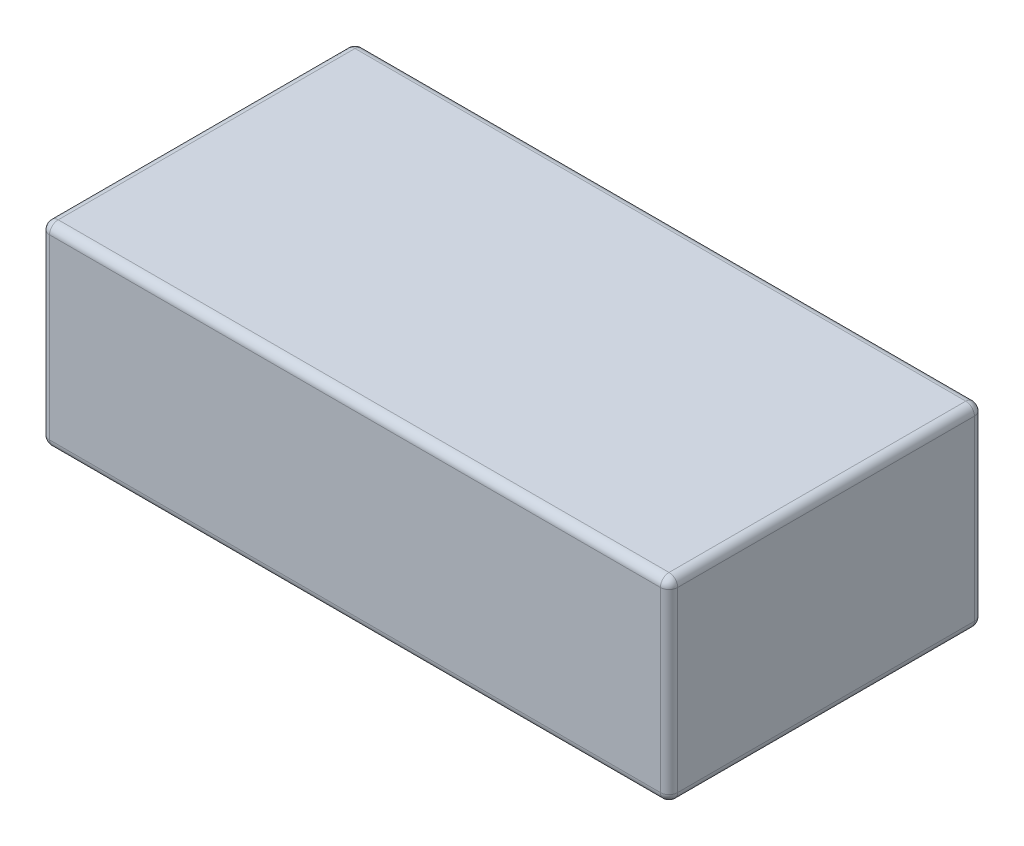
ISO-10303-21;
HEADER;
FILE_DESCRIPTION(('STEP AP214'),'2;1');
FILE_NAME('part.step','',(''),(''),'','','');
FILE_SCHEMA(('AUTOMOTIVE_DESIGN { 1 0 10303 214 1 1 1 1 }'));
ENDSEC;
DATA;
#1=APPLICATION_CONTEXT('core data for automotive mechanical design processes');
#2=APPLICATION_PROTOCOL_DEFINITION('international standard','automotive_design',2000,#1);
#3=PRODUCT_CONTEXT('',#1,'mechanical');
#4=PRODUCT('Part','Part','',(#3));
#5=PRODUCT_RELATED_PRODUCT_CATEGORY('part','',(#4));
#6=PRODUCT_DEFINITION_FORMATION('','',#4);
#7=PRODUCT_DEFINITION_CONTEXT('part definition',#1,'design');
#8=PRODUCT_DEFINITION('design','',#6,#7);
#9=PRODUCT_DEFINITION_SHAPE('','',#8);
#10=(LENGTH_UNIT() NAMED_UNIT(*) SI_UNIT(.MILLI.,.METRE.));
#11=(NAMED_UNIT(*) PLANE_ANGLE_UNIT() SI_UNIT($,.RADIAN.));
#12=(NAMED_UNIT(*) SI_UNIT($,.STERADIAN.) SOLID_ANGLE_UNIT());
#13=UNCERTAINTY_MEASURE_WITH_UNIT(LENGTH_MEASURE(1.E-05),#10,'distance_accuracy_value','');
#14=(GEOMETRIC_REPRESENTATION_CONTEXT(3) GLOBAL_UNCERTAINTY_ASSIGNED_CONTEXT((#13)) GLOBAL_UNIT_ASSIGNED_CONTEXT((#10,
#11,#12)) REPRESENTATION_CONTEXT('',''));
#15=CARTESIAN_POINT('',(0.,0.,0.));
#16=DIRECTION('',(0.,0.,1.));
#17=DIRECTION('',(1.,0.,0.));
#18=AXIS2_PLACEMENT_3D('',#15,#16,#17);
#19=CARTESIAN_POINT('',(92.075,57.15,-46.0375));
#20=DIRECTION('',(-1.,0.,0.));
#21=DIRECTION('',(0.,0.,1.));
#22=AXIS2_PLACEMENT_3D('',#19,#20,#21);
#23=PLANE('',#22);
#24=DIRECTION('',(0.,-1.,0.));
#25=VECTOR('',#24,1.);
#26=CARTESIAN_POINT('',(92.075,57.15,43.4975));
#27=LINE('',#26,#25);
#28=CARTESIAN_POINT('',(92.075,54.61,43.4975));
#29=VERTEX_POINT('',#28);
#30=CARTESIAN_POINT('',(92.075,2.54,43.4975));
#31=VERTEX_POINT('',#30);
#32=EDGE_CURVE('E168',#29,#31,#27,.T.);
#33=ORIENTED_EDGE('',*,*,#32,.T.);
#34=DIRECTION('',(0.,0.,-1.));
#35=VECTOR('',#34,1.);
#36=CARTESIAN_POINT('',(92.075,2.54,-46.0375));
#37=LINE('',#36,#35);
#38=CARTESIAN_POINT('',(92.075,2.54,-43.4975));
#39=VERTEX_POINT('',#38);
#40=EDGE_CURVE('E173',#31,#39,#37,.T.);
#41=ORIENTED_EDGE('',*,*,#40,.T.);
#42=DIRECTION('',(0.,-1.,0.));
#43=VECTOR('',#42,1.);
#44=CARTESIAN_POINT('',(92.075,57.15,-43.4975));
#45=LINE('',#44,#43);
#46=CARTESIAN_POINT('',(92.075,54.61,-43.4975));
#47=VERTEX_POINT('',#46);
#48=EDGE_CURVE('E170',#39,#47,#45,.F.);
#49=ORIENTED_EDGE('',*,*,#48,.T.);
#50=DIRECTION('',(0.,0.,-1.));
#51=VECTOR('',#50,1.);
#52=CARTESIAN_POINT('',(92.075,54.61,46.0375));
#53=LINE('',#52,#51);
#54=EDGE_CURVE('E166',#47,#29,#53,.F.);
#55=ORIENTED_EDGE('',*,*,#54,.T.);
#56=EDGE_LOOP('',(#33,#41,#49,#55));
#57=FACE_BOUND('',#56,.T.);
#58=ADVANCED_FACE('F35',(#57),#23,.F.);
#59=CARTESIAN_POINT('',(-92.075,57.15,-46.0375));
#60=DIRECTION('',(0.,0.,1.));
#61=DIRECTION('',(1.,0.,0.));
#62=AXIS2_PLACEMENT_3D('',#59,#60,#61);
#63=PLANE('',#62);
#64=DIRECTION('',(0.,-1.,0.));
#65=VECTOR('',#64,1.);
#66=CARTESIAN_POINT('',(89.535,57.15,-46.0375));
#67=LINE('',#66,#65);
#68=CARTESIAN_POINT('',(89.535,54.61,-46.0375));
#69=VERTEX_POINT('',#68);
#70=CARTESIAN_POINT('',(89.535,2.54,-46.0375));
#71=VERTEX_POINT('',#70);
#72=EDGE_CURVE('E134',#69,#71,#67,.T.);
#73=ORIENTED_EDGE('',*,*,#72,.T.);
#74=DIRECTION('',(-1.,0.,0.));
#75=VECTOR('',#74,1.);
#76=CARTESIAN_POINT('',(-92.075,2.54,-46.0375));
#77=LINE('',#76,#75);
#78=CARTESIAN_POINT('',(-89.535,2.54,-46.0375));
#79=VERTEX_POINT('',#78);
#80=EDGE_CURVE('E130',#71,#79,#77,.T.);
#81=ORIENTED_EDGE('',*,*,#80,.T.);
#82=DIRECTION('',(0.,-1.,0.));
#83=VECTOR('',#82,1.);
#84=CARTESIAN_POINT('',(-89.535,57.15,-46.0375));
#85=LINE('',#84,#83);
#86=CARTESIAN_POINT('',(-89.535,54.61,-46.0375));
#87=VERTEX_POINT('',#86);
#88=EDGE_CURVE('E122',#79,#87,#85,.F.);
#89=ORIENTED_EDGE('',*,*,#88,.T.);
#90=DIRECTION('',(-1.,0.,0.));
#91=VECTOR('',#90,1.);
#92=CARTESIAN_POINT('',(92.075,54.61,-46.0375));
#93=LINE('',#92,#91);
#94=EDGE_CURVE('E127',#87,#69,#93,.F.);
#95=ORIENTED_EDGE('',*,*,#94,.T.);
#96=EDGE_LOOP('',(#73,#81,#89,#95));
#97=FACE_BOUND('',#96,.T.);
#98=ADVANCED_FACE('F125',(#97),#63,.F.);
#99=CARTESIAN_POINT('',(-92.075,57.15,-46.0375));
#100=DIRECTION('',(1.,0.,0.));
#101=DIRECTION('',(0.,0.,-1.));
#102=AXIS2_PLACEMENT_3D('',#99,#100,#101);
#103=PLANE('',#102);
#104=DIRECTION('',(0.,-1.,0.));
#105=VECTOR('',#104,1.);
#106=CARTESIAN_POINT('',(-92.075,57.15,-43.4975));
#107=LINE('',#106,#105);
#108=CARTESIAN_POINT('',(-92.075,54.61,-43.4975));
#109=VERTEX_POINT('',#108);
#110=CARTESIAN_POINT('',(-92.075,2.54,-43.4975));
#111=VERTEX_POINT('',#110);
#112=EDGE_CURVE('E142',#109,#111,#107,.T.);
#113=ORIENTED_EDGE('',*,*,#112,.T.);
#114=DIRECTION('',(0.,0.,1.));
#115=VECTOR('',#114,1.);
#116=CARTESIAN_POINT('',(-92.075,2.54,-46.0375));
#117=LINE('',#116,#115);
#118=CARTESIAN_POINT('',(-92.075,2.54,43.4975));
#119=VERTEX_POINT('',#118);
#120=EDGE_CURVE('E180',#111,#119,#117,.T.);
#121=ORIENTED_EDGE('',*,*,#120,.T.);
#122=DIRECTION('',(0.,-1.,0.));
#123=VECTOR('',#122,1.);
#124=CARTESIAN_POINT('',(-92.075,57.15,43.4975));
#125=LINE('',#124,#123);
#126=CARTESIAN_POINT('',(-92.075,54.61,43.4975));
#127=VERTEX_POINT('',#126);
#128=EDGE_CURVE('E177',#119,#127,#125,.F.);
#129=ORIENTED_EDGE('',*,*,#128,.T.);
#130=DIRECTION('',(0.,0.,1.));
#131=VECTOR('',#130,1.);
#132=CARTESIAN_POINT('',(-92.075,54.61,-46.0375));
#133=LINE('',#132,#131);
#134=EDGE_CURVE('E175',#127,#109,#133,.F.);
#135=ORIENTED_EDGE('',*,*,#134,.T.);
#136=EDGE_LOOP('',(#113,#121,#129,#135));
#137=FACE_BOUND('',#136,.T.);
#138=ADVANCED_FACE('F326',(#137),#103,.F.);
#139=CARTESIAN_POINT('',(-92.075,57.15,46.0375));
#140=DIRECTION('',(0.,0.,-1.));
#141=DIRECTION('',(-1.,0.,0.));
#142=AXIS2_PLACEMENT_3D('',#139,#140,#141);
#143=PLANE('',#142);
#144=DIRECTION('',(0.,-1.,0.));
#145=VECTOR('',#144,1.);
#146=CARTESIAN_POINT('',(-89.535,57.15,46.0375));
#147=LINE('',#146,#145);
#148=CARTESIAN_POINT('',(-89.535,54.61,46.0375));
#149=VERTEX_POINT('',#148);
#150=CARTESIAN_POINT('',(-89.535,2.54,46.0375));
#151=VERTEX_POINT('',#150);
#152=EDGE_CURVE('E186',#149,#151,#147,.T.);
#153=ORIENTED_EDGE('',*,*,#152,.T.);
#154=DIRECTION('',(1.,0.,0.));
#155=VECTOR('',#154,1.);
#156=CARTESIAN_POINT('',(-92.075,2.54,46.0375));
#157=LINE('',#156,#155);
#158=CARTESIAN_POINT('',(89.535,2.54,46.0375));
#159=VERTEX_POINT('',#158);
#160=EDGE_CURVE('E189',#151,#159,#157,.T.);
#161=ORIENTED_EDGE('',*,*,#160,.T.);
#162=DIRECTION('',(0.,-1.,0.));
#163=VECTOR('',#162,1.);
#164=CARTESIAN_POINT('',(89.535,57.15,46.0375));
#165=LINE('',#164,#163);
#166=CARTESIAN_POINT('',(89.535,54.61,46.0375));
#167=VERTEX_POINT('',#166);
#168=EDGE_CURVE('E184',#159,#167,#165,.F.);
#169=ORIENTED_EDGE('',*,*,#168,.T.);
#170=DIRECTION('',(1.,0.,0.));
#171=VECTOR('',#170,1.);
#172=CARTESIAN_POINT('',(-92.075,54.61,46.0375));
#173=LINE('',#172,#171);
#174=EDGE_CURVE('E182',#167,#149,#173,.F.);
#175=ORIENTED_EDGE('',*,*,#174,.T.);
#176=EDGE_LOOP('',(#153,#161,#169,#175));
#177=FACE_BOUND('',#176,.T.);
#178=ADVANCED_FACE('F275',(#177),#143,.F.);
#179=CARTESIAN_POINT('',(0.,57.15,0.));
#180=DIRECTION('',(0.,1.,0.));
#181=DIRECTION('',(0.,0.,1.));
#182=AXIS2_PLACEMENT_3D('',#179,#180,#181);
#183=PLANE('',#182);
#184=DIRECTION('',(0.,0.,1.));
#185=VECTOR('',#184,1.);
#186=CARTESIAN_POINT('',(-89.535,57.15,46.0375));
#187=LINE('',#186,#185);
#188=CARTESIAN_POINT('',(-89.535,57.15,-43.4975));
#189=VERTEX_POINT('',#188);
#190=CARTESIAN_POINT('',(-89.535,57.15,43.4975));
#191=VERTEX_POINT('',#190);
#192=EDGE_CURVE('E44',#189,#191,#187,.T.);
#193=ORIENTED_EDGE('',*,*,#192,.T.);
#194=DIRECTION('',(1.,0.,0.));
#195=VECTOR('',#194,1.);
#196=CARTESIAN_POINT('',(92.075,57.15,43.4975));
#197=LINE('',#196,#195);
#198=CARTESIAN_POINT('',(89.535,57.15,43.4975));
#199=VERTEX_POINT('',#198);
#200=EDGE_CURVE('E11',#191,#199,#197,.T.);
#201=ORIENTED_EDGE('',*,*,#200,.T.);
#202=DIRECTION('',(0.,0.,-1.));
#203=VECTOR('',#202,1.);
#204=CARTESIAN_POINT('',(89.535,57.15,-46.0375));
#205=LINE('',#204,#203);
#206=CARTESIAN_POINT('',(89.535,57.15,-43.4975));
#207=VERTEX_POINT('',#206);
#208=EDGE_CURVE('E200',#199,#207,#205,.T.);
#209=ORIENTED_EDGE('',*,*,#208,.T.);
#210=DIRECTION('',(-1.,0.,0.));
#211=VECTOR('',#210,1.);
#212=CARTESIAN_POINT('',(-92.075,57.15,-43.4975));
#213=LINE('',#212,#211);
#214=EDGE_CURVE('E55',#207,#189,#213,.T.);
#215=ORIENTED_EDGE('',*,*,#214,.T.);
#216=EDGE_LOOP('',(#193,#201,#209,#215));
#217=FACE_BOUND('',#216,.T.);
#218=ADVANCED_FACE('F290',(#217),#183,.T.);
#219=CARTESIAN_POINT('',(0.,0.,0.));
#220=DIRECTION('',(0.,1.,0.));
#221=DIRECTION('',(0.,0.,1.));
#222=AXIS2_PLACEMENT_3D('',#219,#220,#221);
#223=PLANE('',#222);
#224=DIRECTION('',(0.,0.,1.));
#225=VECTOR('',#224,1.);
#226=CARTESIAN_POINT('',(-89.535,0.,0.));
#227=LINE('',#226,#225);
#228=CARTESIAN_POINT('',(-89.535,0.,43.4975));
#229=VERTEX_POINT('',#228);
#230=CARTESIAN_POINT('',(-89.535,0.,-43.4975));
#231=VERTEX_POINT('',#230);
#232=EDGE_CURVE('E195',#229,#231,#227,.F.);
#233=ORIENTED_EDGE('',*,*,#232,.T.);
#234=DIRECTION('',(-1.,0.,0.));
#235=VECTOR('',#234,1.);
#236=CARTESIAN_POINT('',(0.,0.,-43.4975));
#237=LINE('',#236,#235);
#238=CARTESIAN_POINT('',(89.535,0.,-43.4975));
#239=VERTEX_POINT('',#238);
#240=EDGE_CURVE('E197',#231,#239,#237,.F.);
#241=ORIENTED_EDGE('',*,*,#240,.T.);
#242=DIRECTION('',(0.,0.,-1.));
#243=VECTOR('',#242,1.);
#244=CARTESIAN_POINT('',(89.535,0.,0.));
#245=LINE('',#244,#243);
#246=CARTESIAN_POINT('',(89.535,0.,43.4975));
#247=VERTEX_POINT('',#246);
#248=EDGE_CURVE('E191',#239,#247,#245,.F.);
#249=ORIENTED_EDGE('',*,*,#248,.T.);
#250=DIRECTION('',(1.,0.,0.));
#251=VECTOR('',#250,1.);
#252=CARTESIAN_POINT('',(0.,0.,43.4975));
#253=LINE('',#252,#251);
#254=EDGE_CURVE('E193',#247,#229,#253,.F.);
#255=ORIENTED_EDGE('',*,*,#254,.T.);
#256=EDGE_LOOP('',(#233,#241,#249,#255));
#257=FACE_BOUND('',#256,.T.);
#258=ADVANCED_FACE('F266',(#257),#223,.F.);
#259=CARTESIAN_POINT('',(-89.535,57.15,43.4975));
#260=DIRECTION('',(0.,-1.,0.));
#261=DIRECTION('',(0.,0.,-1.));
#262=AXIS2_PLACEMENT_3D('',#259,#260,#261);
#263=CYLINDRICAL_SURFACE('',#262,2.54);
#264=CARTESIAN_POINT('',(-89.535,54.61,43.4975));
#265=DIRECTION('',(0.,1.,0.));
#266=DIRECTION('',(0.,0.,1.));
#267=AXIS2_PLACEMENT_3D('',#264,#265,#266);
#268=CIRCLE('',#267,2.54);
#269=EDGE_CURVE('E39',#127,#149,#268,.T.);
#270=ORIENTED_EDGE('',*,*,#269,.F.);
#271=ORIENTED_EDGE('',*,*,#128,.F.);
#272=CARTESIAN_POINT('',(-89.535,2.54,43.4975));
#273=DIRECTION('',(0.,-1.,0.));
#274=DIRECTION('',(0.,0.,-1.));
#275=AXIS2_PLACEMENT_3D('',#272,#273,#274);
#276=CIRCLE('',#275,2.54);
#277=EDGE_CURVE('E162',#151,#119,#276,.T.);
#278=ORIENTED_EDGE('',*,*,#277,.F.);
#279=ORIENTED_EDGE('',*,*,#152,.F.);
#280=EDGE_LOOP('',(#270,#271,#278,#279));
#281=FACE_BOUND('',#280,.T.);
#282=ADVANCED_FACE('F37',(#281),#263,.T.);
#283=CARTESIAN_POINT('',(-89.535,54.61,43.4975));
#284=DIRECTION('',(0.,0.,1.));
#285=DIRECTION('',(1.,0.,0.));
#286=AXIS2_PLACEMENT_3D('',#283,#284,#285);
#287=SPHERICAL_SURFACE('',#286,2.54);
#288=CARTESIAN_POINT('',(-89.535,54.61,43.4975));
#289=DIRECTION('',(0.,0.,1.));
#290=DIRECTION('',(1.,0.,0.));
#291=AXIS2_PLACEMENT_3D('',#288,#289,#290);
#292=CIRCLE('',#291,2.54);
#293=EDGE_CURVE('E246',#127,#191,#292,.F.);
#294=ORIENTED_EDGE('',*,*,#293,.F.);
#295=ORIENTED_EDGE('',*,*,#269,.T.);
#296=CARTESIAN_POINT('',(-89.535,54.61,43.4975));
#297=DIRECTION('',(-1.,0.,0.));
#298=DIRECTION('',(0.,0.,1.));
#299=AXIS2_PLACEMENT_3D('',#296,#297,#298);
#300=CIRCLE('',#299,2.54);
#301=EDGE_CURVE('E248',#191,#149,#300,.F.);
#302=ORIENTED_EDGE('',*,*,#301,.F.);
#303=EDGE_LOOP('',(#294,#295,#302));
#304=FACE_BOUND('',#303,.T.);
#305=ADVANCED_FACE('F459',(#304),#287,.T.);
#306=CARTESIAN_POINT('',(-89.535,2.54,43.4975));
#307=DIRECTION('',(0.,0.,1.));
#308=DIRECTION('',(1.,0.,0.));
#309=AXIS2_PLACEMENT_3D('',#306,#307,#308);
#310=SPHERICAL_SURFACE('',#309,2.54);
#311=CARTESIAN_POINT('',(-89.535,2.54,43.4975));
#312=DIRECTION('',(-1.,0.,0.));
#313=DIRECTION('',(0.,0.,1.));
#314=AXIS2_PLACEMENT_3D('',#311,#312,#313);
#315=CIRCLE('',#314,2.54);
#316=EDGE_CURVE('E240',#151,#229,#315,.F.);
#317=ORIENTED_EDGE('',*,*,#316,.F.);
#318=ORIENTED_EDGE('',*,*,#277,.T.);
#319=CARTESIAN_POINT('',(-89.535,2.54,43.4975));
#320=DIRECTION('',(0.,0.,1.));
#321=DIRECTION('',(1.,0.,0.));
#322=AXIS2_PLACEMENT_3D('',#319,#320,#321);
#323=CIRCLE('',#322,2.54);
#324=EDGE_CURVE('E243',#229,#119,#323,.F.);
#325=ORIENTED_EDGE('',*,*,#324,.F.);
#326=EDGE_LOOP('',(#317,#318,#325));
#327=FACE_BOUND('',#326,.T.);
#328=ADVANCED_FACE('F255',(#327),#310,.T.);
#329=CARTESIAN_POINT('',(0.,54.61,43.4975));
#330=DIRECTION('',(-1.,0.,0.));
#331=DIRECTION('',(0.,0.,1.));
#332=AXIS2_PLACEMENT_3D('',#329,#330,#331);
#333=CYLINDRICAL_SURFACE('',#332,2.54);
#334=ORIENTED_EDGE('',*,*,#301,.T.);
#335=ORIENTED_EDGE('',*,*,#174,.F.);
#336=CARTESIAN_POINT('',(89.535,54.61,43.4975));
#337=DIRECTION('',(1.,0.,0.));
#338=DIRECTION('',(0.,0.,-1.));
#339=AXIS2_PLACEMENT_3D('',#336,#337,#338);
#340=CIRCLE('',#339,2.54);
#341=EDGE_CURVE('E234',#199,#167,#340,.T.);
#342=ORIENTED_EDGE('',*,*,#341,.F.);
#343=ORIENTED_EDGE('',*,*,#200,.F.);
#344=EDGE_LOOP('',(#334,#335,#342,#343));
#345=FACE_BOUND('',#344,.T.);
#346=ADVANCED_FACE('F289',(#345),#333,.T.);
#347=CARTESIAN_POINT('',(-89.535,54.61,0.));
#348=DIRECTION('',(0.,0.,-1.));
#349=DIRECTION('',(-1.,0.,0.));
#350=AXIS2_PLACEMENT_3D('',#347,#348,#349);
#351=CYLINDRICAL_SURFACE('',#350,2.54);
#352=ORIENTED_EDGE('',*,*,#293,.T.);
#353=ORIENTED_EDGE('',*,*,#192,.F.);
#354=CARTESIAN_POINT('',(-89.535,54.61,-43.4975));
#355=DIRECTION('',(0.,0.,-1.));
#356=DIRECTION('',(-1.,0.,0.));
#357=AXIS2_PLACEMENT_3D('',#354,#355,#356);
#358=CIRCLE('',#357,2.54);
#359=EDGE_CURVE('E146',#109,#189,#358,.T.);
#360=ORIENTED_EDGE('',*,*,#359,.F.);
#361=ORIENTED_EDGE('',*,*,#134,.F.);
#362=EDGE_LOOP('',(#352,#353,#360,#361));
#363=FACE_BOUND('',#362,.T.);
#364=ADVANCED_FACE('F436',(#363),#351,.T.);
#365=CARTESIAN_POINT('',(-89.535,57.15,-43.4975));
#366=DIRECTION('',(0.,-1.,0.));
#367=DIRECTION('',(0.,0.,-1.));
#368=AXIS2_PLACEMENT_3D('',#365,#366,#367);
#369=CYLINDRICAL_SURFACE('',#368,2.54);
#370=CARTESIAN_POINT('',(-89.535,2.54,-43.4975));
#371=DIRECTION('',(0.,-1.,0.));
#372=DIRECTION('',(0.,0.,-1.));
#373=AXIS2_PLACEMENT_3D('',#370,#371,#372);
#374=CIRCLE('',#373,2.54);
#375=EDGE_CURVE('E147',#111,#79,#374,.T.);
#376=ORIENTED_EDGE('',*,*,#375,.F.);
#377=ORIENTED_EDGE('',*,*,#112,.F.);
#378=CARTESIAN_POINT('',(-89.535,54.61,-43.4975));
#379=DIRECTION('',(0.,1.,0.));
#380=DIRECTION('',(0.,0.,1.));
#381=AXIS2_PLACEMENT_3D('',#378,#379,#380);
#382=CIRCLE('',#381,2.54);
#383=EDGE_CURVE('E138',#87,#109,#382,.T.);
#384=ORIENTED_EDGE('',*,*,#383,.F.);
#385=ORIENTED_EDGE('',*,*,#88,.F.);
#386=EDGE_LOOP('',(#376,#377,#384,#385));
#387=FACE_BOUND('',#386,.T.);
#388=ADVANCED_FACE('F140',(#387),#369,.T.);
#389=CARTESIAN_POINT('',(-89.535,2.54,-46.0375));
#390=DIRECTION('',(0.,0.,1.));
#391=DIRECTION('',(1.,0.,0.));
#392=AXIS2_PLACEMENT_3D('',#389,#390,#391);
#393=CYLINDRICAL_SURFACE('',#392,2.54);
#394=ORIENTED_EDGE('',*,*,#324,.T.);
#395=ORIENTED_EDGE('',*,*,#120,.F.);
#396=CARTESIAN_POINT('',(-89.535,2.54,-43.4975));
#397=DIRECTION('',(0.,0.,-1.));
#398=DIRECTION('',(-1.,0.,0.));
#399=AXIS2_PLACEMENT_3D('',#396,#397,#398);
#400=CIRCLE('',#399,2.54);
#401=EDGE_CURVE('E230',#231,#111,#400,.T.);
#402=ORIENTED_EDGE('',*,*,#401,.F.);
#403=ORIENTED_EDGE('',*,*,#232,.F.);
#404=EDGE_LOOP('',(#394,#395,#402,#403));
#405=FACE_BOUND('',#404,.T.);
#406=ADVANCED_FACE('F262',(#405),#393,.T.);
#407=CARTESIAN_POINT('',(-92.075,2.54,43.4975));
#408=DIRECTION('',(1.,0.,0.));
#409=DIRECTION('',(0.,0.,-1.));
#410=AXIS2_PLACEMENT_3D('',#407,#408,#409);
#411=CYLINDRICAL_SURFACE('',#410,2.54);
#412=ORIENTED_EDGE('',*,*,#316,.T.);
#413=ORIENTED_EDGE('',*,*,#254,.F.);
#414=CARTESIAN_POINT('',(89.535,2.54,43.4975));
#415=DIRECTION('',(1.,0.,0.));
#416=DIRECTION('',(0.,0.,-1.));
#417=AXIS2_PLACEMENT_3D('',#414,#415,#416);
#418=CIRCLE('',#417,2.54);
#419=EDGE_CURVE('E227',#159,#247,#418,.T.);
#420=ORIENTED_EDGE('',*,*,#419,.F.);
#421=ORIENTED_EDGE('',*,*,#160,.F.);
#422=EDGE_LOOP('',(#412,#413,#420,#421));
#423=FACE_BOUND('',#422,.T.);
#424=ADVANCED_FACE('F272',(#423),#411,.T.);
#425=CARTESIAN_POINT('',(89.535,57.15,43.4975));
#426=DIRECTION('',(0.,-1.,0.));
#427=DIRECTION('',(0.,0.,-1.));
#428=AXIS2_PLACEMENT_3D('',#425,#426,#427);
#429=CYLINDRICAL_SURFACE('',#428,2.54);
#430=CARTESIAN_POINT('',(89.535,54.61,43.4975));
#431=DIRECTION('',(0.,1.,0.));
#432=DIRECTION('',(0.,0.,1.));
#433=AXIS2_PLACEMENT_3D('',#430,#431,#432);
#434=CIRCLE('',#433,2.54);
#435=EDGE_CURVE('E237',#167,#29,#434,.T.);
#436=ORIENTED_EDGE('',*,*,#435,.F.);
#437=ORIENTED_EDGE('',*,*,#168,.F.);
#438=CARTESIAN_POINT('',(89.535,2.54,43.4975));
#439=DIRECTION('',(0.,-1.,0.));
#440=DIRECTION('',(0.,0.,-1.));
#441=AXIS2_PLACEMENT_3D('',#438,#439,#440);
#442=CIRCLE('',#441,2.54);
#443=EDGE_CURVE('E224',#31,#159,#442,.T.);
#444=ORIENTED_EDGE('',*,*,#443,.F.);
#445=ORIENTED_EDGE('',*,*,#32,.F.);
#446=EDGE_LOOP('',(#436,#437,#444,#445));
#447=FACE_BOUND('',#446,.T.);
#448=ADVANCED_FACE('F280',(#447),#429,.T.);
#449=CARTESIAN_POINT('',(89.535,54.61,43.4975));
#450=DIRECTION('',(0.,0.,1.));
#451=DIRECTION('',(1.,0.,0.));
#452=AXIS2_PLACEMENT_3D('',#449,#450,#451);
#453=SPHERICAL_SURFACE('',#452,2.54);
#454=ORIENTED_EDGE('',*,*,#341,.T.);
#455=ORIENTED_EDGE('',*,*,#435,.T.);
#456=CARTESIAN_POINT('',(89.535,54.61,43.4975));
#457=DIRECTION('',(0.,0.,1.));
#458=DIRECTION('',(1.,0.,0.));
#459=AXIS2_PLACEMENT_3D('',#456,#457,#458);
#460=CIRCLE('',#459,2.54);
#461=EDGE_CURVE('E153',#199,#29,#460,.F.);
#462=ORIENTED_EDGE('',*,*,#461,.F.);
#463=EDGE_LOOP('',(#454,#455,#462));
#464=FACE_BOUND('',#463,.T.);
#465=ADVANCED_FACE('F286',(#464),#453,.T.);
#466=CARTESIAN_POINT('',(-89.535,54.61,-43.4975));
#467=DIRECTION('',(0.,0.,1.));
#468=DIRECTION('',(1.,0.,0.));
#469=AXIS2_PLACEMENT_3D('',#466,#467,#468);
#470=SPHERICAL_SURFACE('',#469,2.54);
#471=ORIENTED_EDGE('',*,*,#383,.T.);
#472=ORIENTED_EDGE('',*,*,#359,.T.);
#473=CARTESIAN_POINT('',(-89.535,54.61,-43.4975));
#474=DIRECTION('',(-1.,0.,0.));
#475=DIRECTION('',(0.,0.,1.));
#476=AXIS2_PLACEMENT_3D('',#473,#474,#475);
#477=CIRCLE('',#476,2.54);
#478=EDGE_CURVE('E150',#87,#189,#477,.F.);
#479=ORIENTED_EDGE('',*,*,#478,.F.);
#480=EDGE_LOOP('',(#471,#472,#479));
#481=FACE_BOUND('',#480,.T.);
#482=ADVANCED_FACE('F151',(#481),#470,.T.);
#483=CARTESIAN_POINT('',(-89.535,2.54,-43.4975));
#484=DIRECTION('',(0.,0.,1.));
#485=DIRECTION('',(1.,0.,0.));
#486=AXIS2_PLACEMENT_3D('',#483,#484,#485);
#487=SPHERICAL_SURFACE('',#486,2.54);
#488=ORIENTED_EDGE('',*,*,#401,.T.);
#489=ORIENTED_EDGE('',*,*,#375,.T.);
#490=CARTESIAN_POINT('',(-89.535,2.54,-43.4975));
#491=DIRECTION('',(-1.,0.,0.));
#492=DIRECTION('',(0.,0.,1.));
#493=AXIS2_PLACEMENT_3D('',#490,#491,#492);
#494=CIRCLE('',#493,2.54);
#495=EDGE_CURVE('E154',#231,#79,#494,.F.);
#496=ORIENTED_EDGE('',*,*,#495,.F.);
#497=EDGE_LOOP('',(#488,#489,#496));
#498=FACE_BOUND('',#497,.T.);
#499=ADVANCED_FACE('F309',(#498),#487,.T.);
#500=CARTESIAN_POINT('',(89.535,2.54,43.4975));
#501=DIRECTION('',(0.,0.,1.));
#502=DIRECTION('',(1.,0.,0.));
#503=AXIS2_PLACEMENT_3D('',#500,#501,#502);
#504=SPHERICAL_SURFACE('',#503,2.54);
#505=ORIENTED_EDGE('',*,*,#443,.T.);
#506=ORIENTED_EDGE('',*,*,#419,.T.);
#507=CARTESIAN_POINT('',(89.535,2.54,43.4975));
#508=DIRECTION('',(0.,0.,1.));
#509=DIRECTION('',(1.,0.,0.));
#510=AXIS2_PLACEMENT_3D('',#507,#508,#509);
#511=CIRCLE('',#510,2.54);
#512=EDGE_CURVE('E217',#31,#247,#511,.F.);
#513=ORIENTED_EDGE('',*,*,#512,.F.);
#514=EDGE_LOOP('',(#505,#506,#513));
#515=FACE_BOUND('',#514,.T.);
#516=ADVANCED_FACE('F311',(#515),#504,.T.);
#517=CARTESIAN_POINT('',(89.535,54.61,0.));
#518=DIRECTION('',(0.,0.,1.));
#519=DIRECTION('',(1.,0.,0.));
#520=AXIS2_PLACEMENT_3D('',#517,#518,#519);
#521=CYLINDRICAL_SURFACE('',#520,2.54);
#522=ORIENTED_EDGE('',*,*,#461,.T.);
#523=ORIENTED_EDGE('',*,*,#54,.F.);
#524=CARTESIAN_POINT('',(89.535,54.61,-43.4975));
#525=DIRECTION('',(0.,0.,-1.));
#526=DIRECTION('',(-1.,0.,0.));
#527=AXIS2_PLACEMENT_3D('',#524,#525,#526);
#528=CIRCLE('',#527,2.54);
#529=EDGE_CURVE('E214',#207,#47,#528,.T.);
#530=ORIENTED_EDGE('',*,*,#529,.F.);
#531=ORIENTED_EDGE('',*,*,#208,.F.);
#532=EDGE_LOOP('',(#522,#523,#530,#531));
#533=FACE_BOUND('',#532,.T.);
#534=ADVANCED_FACE('F294',(#533),#521,.T.);
#535=CARTESIAN_POINT('',(0.,54.61,-43.4975));
#536=DIRECTION('',(1.,0.,0.));
#537=DIRECTION('',(0.,0.,-1.));
#538=AXIS2_PLACEMENT_3D('',#535,#536,#537);
#539=CYLINDRICAL_SURFACE('',#538,2.54);
#540=ORIENTED_EDGE('',*,*,#478,.T.);
#541=ORIENTED_EDGE('',*,*,#214,.F.);
#542=CARTESIAN_POINT('',(89.535,54.61,-43.4975));
#543=DIRECTION('',(1.,0.,0.));
#544=DIRECTION('',(0.,1.,0.));
#545=AXIS2_PLACEMENT_3D('',#542,#543,#544);
#546=CIRCLE('',#545,2.54);
#547=EDGE_CURVE('E158',#69,#207,#546,.T.);
#548=ORIENTED_EDGE('',*,*,#547,.F.);
#549=ORIENTED_EDGE('',*,*,#94,.F.);
#550=EDGE_LOOP('',(#540,#541,#548,#549));
#551=FACE_BOUND('',#550,.T.);
#552=ADVANCED_FACE('F156',(#551),#539,.T.);
#553=CARTESIAN_POINT('',(-92.075,2.54,-43.4975));
#554=DIRECTION('',(-1.,0.,0.));
#555=DIRECTION('',(0.,0.,1.));
#556=AXIS2_PLACEMENT_3D('',#553,#554,#555);
#557=CYLINDRICAL_SURFACE('',#556,2.54);
#558=ORIENTED_EDGE('',*,*,#495,.T.);
#559=ORIENTED_EDGE('',*,*,#80,.F.);
#560=CARTESIAN_POINT('',(89.535,2.54,-43.4975));
#561=DIRECTION('',(1.,0.,0.));
#562=DIRECTION('',(0.,0.,-1.));
#563=AXIS2_PLACEMENT_3D('',#560,#561,#562);
#564=CIRCLE('',#563,2.54);
#565=EDGE_CURVE('E210',#239,#71,#564,.T.);
#566=ORIENTED_EDGE('',*,*,#565,.F.);
#567=ORIENTED_EDGE('',*,*,#240,.F.);
#568=EDGE_LOOP('',(#558,#559,#566,#567));
#569=FACE_BOUND('',#568,.T.);
#570=ADVANCED_FACE('F307',(#569),#557,.T.);
#571=CARTESIAN_POINT('',(89.535,2.54,-46.0375));
#572=DIRECTION('',(0.,0.,-1.));
#573=DIRECTION('',(-1.,0.,0.));
#574=AXIS2_PLACEMENT_3D('',#571,#572,#573);
#575=CYLINDRICAL_SURFACE('',#574,2.54);
#576=ORIENTED_EDGE('',*,*,#512,.T.);
#577=ORIENTED_EDGE('',*,*,#248,.F.);
#578=CARTESIAN_POINT('',(89.535,2.54,-43.4975));
#579=DIRECTION('',(0.,0.,-1.));
#580=DIRECTION('',(-1.,0.,0.));
#581=AXIS2_PLACEMENT_3D('',#578,#579,#580);
#582=CIRCLE('',#581,2.54);
#583=EDGE_CURVE('E208',#39,#239,#582,.T.);
#584=ORIENTED_EDGE('',*,*,#583,.F.);
#585=ORIENTED_EDGE('',*,*,#40,.F.);
#586=EDGE_LOOP('',(#576,#577,#584,#585));
#587=FACE_BOUND('',#586,.T.);
#588=ADVANCED_FACE('F336',(#587),#575,.T.);
#589=CARTESIAN_POINT('',(89.535,54.61,-43.4975));
#590=DIRECTION('',(0.,0.,1.));
#591=DIRECTION('',(1.,0.,0.));
#592=AXIS2_PLACEMENT_3D('',#589,#590,#591);
#593=SPHERICAL_SURFACE('',#592,2.54);
#594=ORIENTED_EDGE('',*,*,#547,.T.);
#595=ORIENTED_EDGE('',*,*,#529,.T.);
#596=CARTESIAN_POINT('',(89.535,54.61,-43.4975));
#597=DIRECTION('',(0.,1.,0.));
#598=DIRECTION('',(0.,0.,1.));
#599=AXIS2_PLACEMENT_3D('',#596,#597,#598);
#600=CIRCLE('',#599,2.54);
#601=EDGE_CURVE('E206',#69,#47,#600,.F.);
#602=ORIENTED_EDGE('',*,*,#601,.F.);
#603=EDGE_LOOP('',(#594,#595,#602));
#604=FACE_BOUND('',#603,.T.);
#605=ADVANCED_FACE('F296',(#604),#593,.T.);
#606=CARTESIAN_POINT('',(89.535,2.54,-43.4975));
#607=DIRECTION('',(0.,0.,1.));
#608=DIRECTION('',(1.,0.,0.));
#609=AXIS2_PLACEMENT_3D('',#606,#607,#608);
#610=SPHERICAL_SURFACE('',#609,2.54);
#611=ORIENTED_EDGE('',*,*,#583,.T.);
#612=ORIENTED_EDGE('',*,*,#565,.T.);
#613=CARTESIAN_POINT('',(89.535,2.54,-43.4975));
#614=DIRECTION('',(0.,-1.,0.));
#615=DIRECTION('',(0.,0.,-1.));
#616=AXIS2_PLACEMENT_3D('',#613,#614,#615);
#617=CIRCLE('',#616,2.54);
#618=EDGE_CURVE('E204',#39,#71,#617,.F.);
#619=ORIENTED_EDGE('',*,*,#618,.F.);
#620=EDGE_LOOP('',(#611,#612,#619));
#621=FACE_BOUND('',#620,.T.);
#622=ADVANCED_FACE('F304',(#621),#610,.T.);
#623=CARTESIAN_POINT('',(89.535,57.15,-43.4975));
#624=DIRECTION('',(0.,-1.,0.));
#625=DIRECTION('',(0.,0.,-1.));
#626=AXIS2_PLACEMENT_3D('',#623,#624,#625);
#627=CYLINDRICAL_SURFACE('',#626,2.54);
#628=ORIENTED_EDGE('',*,*,#601,.T.);
#629=ORIENTED_EDGE('',*,*,#48,.F.);
#630=ORIENTED_EDGE('',*,*,#618,.T.);
#631=ORIENTED_EDGE('',*,*,#72,.F.);
#632=EDGE_LOOP('',(#628,#629,#630,#631));
#633=FACE_BOUND('',#632,.T.);
#634=ADVANCED_FACE('F300',(#633),#627,.T.);
#635=CLOSED_SHELL('',(#58,#98,#138,#178,#218,#258,#282,#305,#328,#346,#364,#388,#406,#424,#448,
#465,#482,#499,#516,#534,#552,#570,#588,#605,#622,#634));
#636=MANIFOLD_SOLID_BREP('B2',#635);
#637=ADVANCED_BREP_SHAPE_REPRESENTATION('',(#18,#636),#14);
#638=SHAPE_DEFINITION_REPRESENTATION(#9,#637);
ENDSEC;
END-ISO-10303-21;
